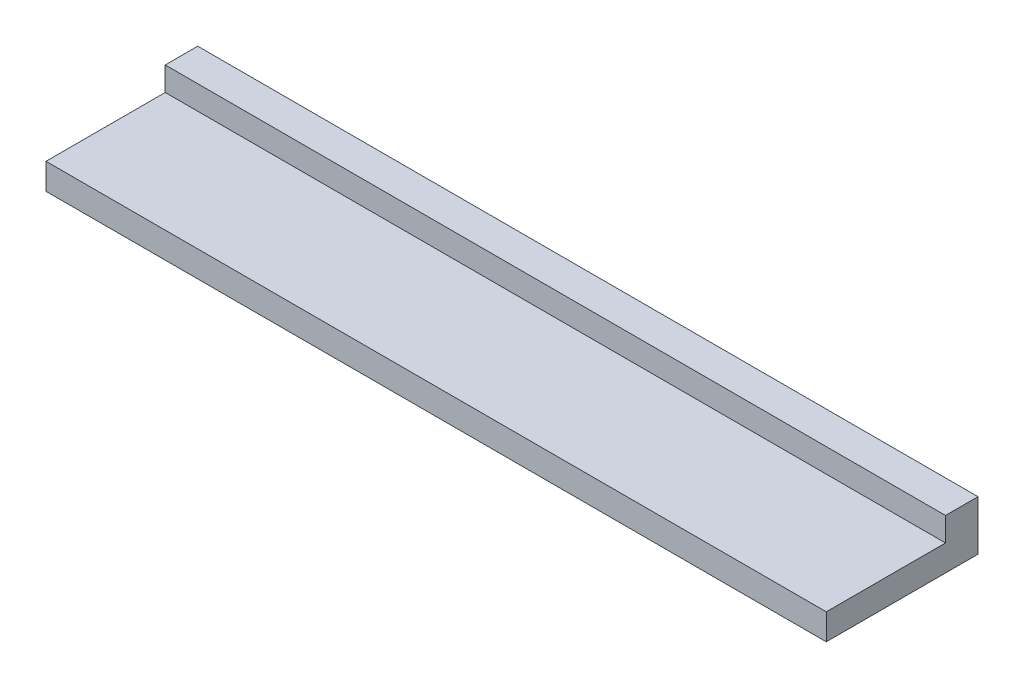
ISO-10303-21;
HEADER;
FILE_DESCRIPTION(('STEP AP214'),'2;1');
FILE_NAME('part.step','',(''),(''),'','','');
FILE_SCHEMA(('AUTOMOTIVE_DESIGN { 1 0 10303 214 1 1 1 1 }'));
ENDSEC;
DATA;
#1=APPLICATION_CONTEXT('core data for automotive mechanical design processes');
#2=APPLICATION_PROTOCOL_DEFINITION('international standard','automotive_design',2000,#1);
#3=PRODUCT_CONTEXT('',#1,'mechanical');
#4=PRODUCT('Part','Part','',(#3));
#5=PRODUCT_RELATED_PRODUCT_CATEGORY('part','',(#4));
#6=PRODUCT_DEFINITION_FORMATION('','',#4);
#7=PRODUCT_DEFINITION_CONTEXT('part definition',#1,'design');
#8=PRODUCT_DEFINITION('design','',#6,#7);
#9=PRODUCT_DEFINITION_SHAPE('','',#8);
#10=(LENGTH_UNIT() NAMED_UNIT(*) SI_UNIT(.MILLI.,.METRE.));
#11=(NAMED_UNIT(*) PLANE_ANGLE_UNIT() SI_UNIT($,.RADIAN.));
#12=(NAMED_UNIT(*) SI_UNIT($,.STERADIAN.) SOLID_ANGLE_UNIT());
#13=UNCERTAINTY_MEASURE_WITH_UNIT(LENGTH_MEASURE(1.E-05),#10,'distance_accuracy_value','');
#14=(GEOMETRIC_REPRESENTATION_CONTEXT(3) GLOBAL_UNCERTAINTY_ASSIGNED_CONTEXT((#13)) GLOBAL_UNIT_ASSIGNED_CONTEXT((#10,
#11,#12)) REPRESENTATION_CONTEXT('',''));
#15=CARTESIAN_POINT('',(0.,0.,0.));
#16=DIRECTION('',(0.,0.,1.));
#17=DIRECTION('',(1.,0.,0.));
#18=AXIS2_PLACEMENT_3D('',#15,#16,#17);
#19=CARTESIAN_POINT('',(90.,6.,-17.5));
#20=DIRECTION('',(-1.,0.,0.));
#21=DIRECTION('',(0.,0.,1.));
#22=AXIS2_PLACEMENT_3D('',#19,#20,#21);
#23=PLANE('',#22);
#24=DIRECTION('',(0.,0.,-1.));
#25=VECTOR('',#24,1.);
#26=CARTESIAN_POINT('',(90.,0.,-17.5));
#27=LINE('',#26,#25);
#28=CARTESIAN_POINT('',(90.,0.,17.5));
#29=VERTEX_POINT('',#28);
#30=CARTESIAN_POINT('',(90.,0.,-17.5));
#31=VERTEX_POINT('',#30);
#32=EDGE_CURVE('E90',#29,#31,#27,.T.);
#33=ORIENTED_EDGE('',*,*,#32,.T.);
#34=DIRECTION('',(0.,-1.,0.));
#35=VECTOR('',#34,1.);
#36=CARTESIAN_POINT('',(90.,6.,-17.5));
#37=LINE('',#36,#35);
#38=CARTESIAN_POINT('',(90.,11.5,-17.5));
#39=VERTEX_POINT('',#38);
#40=EDGE_CURVE('E11',#39,#31,#37,.T.);
#41=ORIENTED_EDGE('',*,*,#40,.F.);
#42=DIRECTION('',(0.,0.,-1.));
#43=VECTOR('',#42,1.);
#44=CARTESIAN_POINT('',(89.9999999999999,11.5,-10.));
#45=LINE('',#44,#43);
#46=CARTESIAN_POINT('',(89.9999999999999,11.5,-10.));
#47=VERTEX_POINT('',#46);
#48=EDGE_CURVE('E129',#47,#39,#45,.T.);
#49=ORIENTED_EDGE('',*,*,#48,.F.);
#50=DIRECTION('',(0.,-1.,0.));
#51=VECTOR('',#50,1.);
#52=CARTESIAN_POINT('',(89.9999999999999,11.5,-10.));
#53=LINE('',#52,#51);
#54=CARTESIAN_POINT('',(89.9999999999999,6.,-10.));
#55=VERTEX_POINT('',#54);
#56=EDGE_CURVE('E99',#47,#55,#53,.T.);
#57=ORIENTED_EDGE('',*,*,#56,.T.);
#58=DIRECTION('',(0.,0.,-1.));
#59=VECTOR('',#58,1.);
#60=CARTESIAN_POINT('',(90.,6.,-17.5));
#61=LINE('',#60,#59);
#62=CARTESIAN_POINT('',(90.,6.,17.5));
#63=VERTEX_POINT('',#62);
#64=EDGE_CURVE('E84',#63,#55,#61,.T.);
#65=ORIENTED_EDGE('',*,*,#64,.F.);
#66=DIRECTION('',(0.,-1.,0.));
#67=VECTOR('',#66,1.);
#68=CARTESIAN_POINT('',(90.,6.,17.5));
#69=LINE('',#68,#67);
#70=EDGE_CURVE('E77',#63,#29,#69,.T.);
#71=ORIENTED_EDGE('',*,*,#70,.T.);
#72=EDGE_LOOP('',(#33,#41,#49,#57,#65,#71));
#73=FACE_BOUND('',#72,.T.);
#74=ADVANCED_FACE('F35',(#73),#23,.F.);
#75=CARTESIAN_POINT('',(-90.,6.,-17.5));
#76=DIRECTION('',(0.,0.,1.));
#77=DIRECTION('',(1.,0.,0.));
#78=AXIS2_PLACEMENT_3D('',#75,#76,#77);
#79=PLANE('',#78);
#80=DIRECTION('',(-1.,0.,0.));
#81=VECTOR('',#80,1.);
#82=CARTESIAN_POINT('',(-90.,0.,-17.5));
#83=LINE('',#82,#81);
#84=CARTESIAN_POINT('',(-90.,0.,-17.5));
#85=VERTEX_POINT('',#84);
#86=EDGE_CURVE('E94',#31,#85,#83,.T.);
#87=ORIENTED_EDGE('',*,*,#86,.T.);
#88=DIRECTION('',(0.,-1.,0.));
#89=VECTOR('',#88,1.);
#90=CARTESIAN_POINT('',(-90.,6.,-17.5));
#91=LINE('',#90,#89);
#92=CARTESIAN_POINT('',(-90.,11.5,-17.5));
#93=VERTEX_POINT('',#92);
#94=EDGE_CURVE('E42',#93,#85,#91,.T.);
#95=ORIENTED_EDGE('',*,*,#94,.F.);
#96=DIRECTION('',(-1.,0.,0.));
#97=VECTOR('',#96,1.);
#98=CARTESIAN_POINT('',(90.,11.5,-17.5));
#99=LINE('',#98,#97);
#100=EDGE_CURVE('E118',#39,#93,#99,.T.);
#101=ORIENTED_EDGE('',*,*,#100,.F.);
#102=ORIENTED_EDGE('',*,*,#40,.T.);
#103=EDGE_LOOP('',(#87,#95,#101,#102));
#104=FACE_BOUND('',#103,.T.);
#105=ADVANCED_FACE('F117',(#104),#79,.F.);
#106=CARTESIAN_POINT('',(-90.,6.,-17.5));
#107=DIRECTION('',(1.,0.,0.));
#108=DIRECTION('',(0.,0.,-1.));
#109=AXIS2_PLACEMENT_3D('',#106,#107,#108);
#110=PLANE('',#109);
#111=DIRECTION('',(0.,0.,1.));
#112=VECTOR('',#111,1.);
#113=CARTESIAN_POINT('',(-90.,0.,-17.5));
#114=LINE('',#113,#112);
#115=CARTESIAN_POINT('',(-90.,0.,17.5));
#116=VERTEX_POINT('',#115);
#117=EDGE_CURVE('E85',#85,#116,#114,.T.);
#118=ORIENTED_EDGE('',*,*,#117,.T.);
#119=DIRECTION('',(0.,-1.,0.));
#120=VECTOR('',#119,1.);
#121=CARTESIAN_POINT('',(-90.,6.,17.5));
#122=LINE('',#121,#120);
#123=CARTESIAN_POINT('',(-90.,6.,17.5));
#124=VERTEX_POINT('',#123);
#125=EDGE_CURVE('E80',#124,#116,#122,.T.);
#126=ORIENTED_EDGE('',*,*,#125,.F.);
#127=DIRECTION('',(0.,0.,1.));
#128=VECTOR('',#127,1.);
#129=CARTESIAN_POINT('',(-90.,6.,-17.5));
#130=LINE('',#129,#128);
#131=CARTESIAN_POINT('',(-90.,6.,-10.));
#132=VERTEX_POINT('',#131);
#133=EDGE_CURVE('E141',#132,#124,#130,.T.);
#134=ORIENTED_EDGE('',*,*,#133,.F.);
#135=DIRECTION('',(0.,-1.,0.));
#136=VECTOR('',#135,1.);
#137=CARTESIAN_POINT('',(-90.,11.5,-10.));
#138=LINE('',#137,#136);
#139=CARTESIAN_POINT('',(-90.,11.5,-10.));
#140=VERTEX_POINT('',#139);
#141=EDGE_CURVE('E95',#140,#132,#138,.T.);
#142=ORIENTED_EDGE('',*,*,#141,.F.);
#143=DIRECTION('',(0.,0.,1.));
#144=VECTOR('',#143,1.);
#145=CARTESIAN_POINT('',(-90.,11.5,-17.5));
#146=LINE('',#145,#144);
#147=EDGE_CURVE('E113',#93,#140,#146,.T.);
#148=ORIENTED_EDGE('',*,*,#147,.F.);
#149=ORIENTED_EDGE('',*,*,#94,.T.);
#150=EDGE_LOOP('',(#118,#126,#134,#142,#148,#149));
#151=FACE_BOUND('',#150,.T.);
#152=ADVANCED_FACE('F109',(#151),#110,.F.);
#153=CARTESIAN_POINT('',(-90.,6.,17.5));
#154=DIRECTION('',(0.,0.,-1.));
#155=DIRECTION('',(-1.,0.,0.));
#156=AXIS2_PLACEMENT_3D('',#153,#154,#155);
#157=PLANE('',#156);
#158=DIRECTION('',(1.,0.,0.));
#159=VECTOR('',#158,1.);
#160=CARTESIAN_POINT('',(-90.,0.,17.5));
#161=LINE('',#160,#159);
#162=EDGE_CURVE('E74',#116,#29,#161,.T.);
#163=ORIENTED_EDGE('',*,*,#162,.T.);
#164=ORIENTED_EDGE('',*,*,#70,.F.);
#165=DIRECTION('',(1.,0.,0.));
#166=VECTOR('',#165,1.);
#167=CARTESIAN_POINT('',(-90.,6.,17.5));
#168=LINE('',#167,#166);
#169=EDGE_CURVE('E55',#124,#63,#168,.T.);
#170=ORIENTED_EDGE('',*,*,#169,.F.);
#171=ORIENTED_EDGE('',*,*,#125,.T.);
#172=EDGE_LOOP('',(#163,#164,#170,#171));
#173=FACE_BOUND('',#172,.T.);
#174=ADVANCED_FACE('F76',(#173),#157,.F.);
#175=CARTESIAN_POINT('',(0.,6.,0.));
#176=DIRECTION('',(0.,1.,0.));
#177=DIRECTION('',(0.,0.,1.));
#178=AXIS2_PLACEMENT_3D('',#175,#176,#177);
#179=PLANE('',#178);
#180=DIRECTION('',(1.,0.,0.));
#181=VECTOR('',#180,1.);
#182=CARTESIAN_POINT('',(-90.,6.,-10.));
#183=LINE('',#182,#181);
#184=EDGE_CURVE('E49',#132,#55,#183,.T.);
#185=ORIENTED_EDGE('',*,*,#184,.F.);
#186=ORIENTED_EDGE('',*,*,#133,.T.);
#187=ORIENTED_EDGE('',*,*,#169,.T.);
#188=ORIENTED_EDGE('',*,*,#64,.T.);
#189=EDGE_LOOP('',(#185,#186,#187,#188));
#190=FACE_BOUND('',#189,.T.);
#191=ADVANCED_FACE('F142',(#190),#179,.T.);
#192=CARTESIAN_POINT('',(0.,0.,0.));
#193=DIRECTION('',(0.,1.,0.));
#194=DIRECTION('',(0.,0.,1.));
#195=AXIS2_PLACEMENT_3D('',#192,#193,#194);
#196=PLANE('',#195);
#197=ORIENTED_EDGE('',*,*,#32,.F.);
#198=ORIENTED_EDGE('',*,*,#162,.F.);
#199=ORIENTED_EDGE('',*,*,#117,.F.);
#200=ORIENTED_EDGE('',*,*,#86,.F.);
#201=EDGE_LOOP('',(#197,#198,#199,#200));
#202=FACE_BOUND('',#201,.T.);
#203=ADVANCED_FACE('F93',(#202),#196,.F.);
#204=CARTESIAN_POINT('',(-90.,11.5,-10.));
#205=DIRECTION('',(0.,0.,-1.));
#206=DIRECTION('',(-1.,0.,0.));
#207=AXIS2_PLACEMENT_3D('',#204,#205,#206);
#208=PLANE('',#207);
#209=ORIENTED_EDGE('',*,*,#184,.T.);
#210=ORIENTED_EDGE('',*,*,#56,.F.);
#211=DIRECTION('',(1.,0.,0.));
#212=VECTOR('',#211,1.);
#213=CARTESIAN_POINT('',(-90.,11.5,-10.));
#214=LINE('',#213,#212);
#215=EDGE_CURVE('E133',#140,#47,#214,.T.);
#216=ORIENTED_EDGE('',*,*,#215,.F.);
#217=ORIENTED_EDGE('',*,*,#141,.T.);
#218=EDGE_LOOP('',(#209,#210,#216,#217));
#219=FACE_BOUND('',#218,.T.);
#220=ADVANCED_FACE('F144',(#219),#208,.F.);
#221=CARTESIAN_POINT('',(0.,11.5,0.));
#222=DIRECTION('',(0.,1.,0.));
#223=DIRECTION('',(0.,0.,1.));
#224=AXIS2_PLACEMENT_3D('',#221,#222,#223);
#225=PLANE('',#224);
#226=ORIENTED_EDGE('',*,*,#100,.T.);
#227=ORIENTED_EDGE('',*,*,#147,.T.);
#228=ORIENTED_EDGE('',*,*,#215,.T.);
#229=ORIENTED_EDGE('',*,*,#48,.T.);
#230=EDGE_LOOP('',(#226,#227,#228,#229));
#231=FACE_BOUND('',#230,.T.);
#232=ADVANCED_FACE('F131',(#231),#225,.T.);
#233=CLOSED_SHELL('',(#74,#105,#152,#174,#191,#203,#220,#232));
#234=MANIFOLD_SOLID_BREP('B2',#233);
#235=ADVANCED_BREP_SHAPE_REPRESENTATION('',(#18,#234),#14);
#236=SHAPE_DEFINITION_REPRESENTATION(#9,#235);
ENDSEC;
END-ISO-10303-21;
